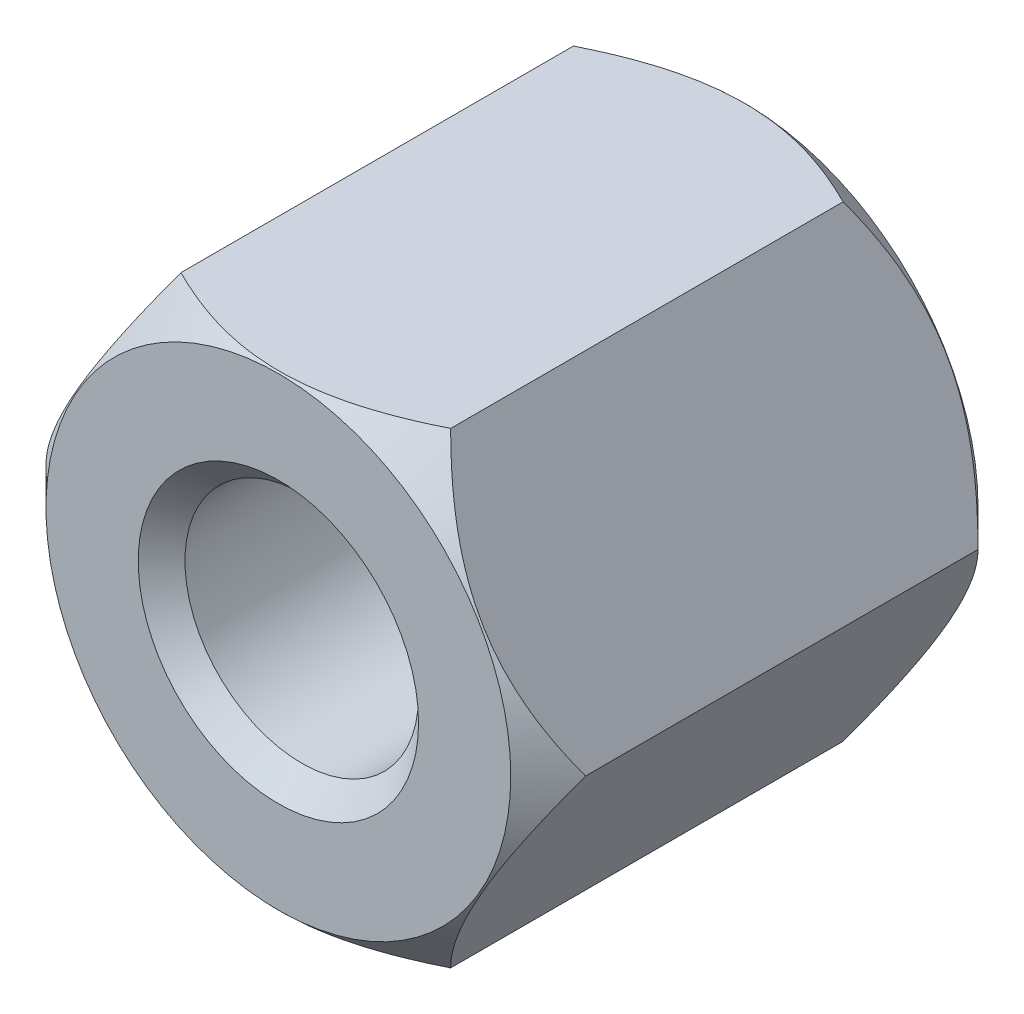
ISO-10303-21;
HEADER;
FILE_DESCRIPTION(('STEP AP214'),'2;1');
FILE_NAME('part.step','',(''),(''),'','','');
FILE_SCHEMA(('AUTOMOTIVE_DESIGN { 1 0 10303 214 1 1 1 1 }'));
ENDSEC;
DATA;
#1=APPLICATION_CONTEXT('core data for automotive mechanical design processes');
#2=APPLICATION_PROTOCOL_DEFINITION('international standard','automotive_design',2000,#1);
#3=PRODUCT_CONTEXT('',#1,'mechanical');
#4=PRODUCT('Part','Part','',(#3));
#5=PRODUCT_RELATED_PRODUCT_CATEGORY('part','',(#4));
#6=PRODUCT_DEFINITION_FORMATION('','',#4);
#7=PRODUCT_DEFINITION_CONTEXT('part definition',#1,'design');
#8=PRODUCT_DEFINITION('design','',#6,#7);
#9=PRODUCT_DEFINITION_SHAPE('','',#8);
#10=(LENGTH_UNIT() NAMED_UNIT(*) SI_UNIT(.MILLI.,.METRE.));
#11=(NAMED_UNIT(*) PLANE_ANGLE_UNIT() SI_UNIT($,.RADIAN.));
#12=(NAMED_UNIT(*) SI_UNIT($,.STERADIAN.) SOLID_ANGLE_UNIT());
#13=UNCERTAINTY_MEASURE_WITH_UNIT(LENGTH_MEASURE(1.E-05),#10,'distance_accuracy_value','');
#14=(GEOMETRIC_REPRESENTATION_CONTEXT(3) GLOBAL_UNCERTAINTY_ASSIGNED_CONTEXT((#13)) GLOBAL_UNIT_ASSIGNED_CONTEXT((#10,
#11,#12)) REPRESENTATION_CONTEXT('',''));
#15=CARTESIAN_POINT('',(0.,0.,0.));
#16=DIRECTION('',(0.,0.,1.));
#17=DIRECTION('',(1.,0.,0.));
#18=AXIS2_PLACEMENT_3D('',#15,#16,#17);
#19=CARTESIAN_POINT('',(1.44337567297409,-2.49999999999998,2.5));
#20=DIRECTION('',(-0.866025403784442,0.499999999999995,0.));
#21=DIRECTION('',(-0.499999999999995,-0.866025403784442,0.));
#22=AXIS2_PLACEMENT_3D('',#19,#20,#21);
#23=PLANE('',#22);
#24=CARTESIAN_POINT('',(1.44326020292026,-2.50019999999998,2.09988452301824));
#25=CARTESIAN_POINT('',(1.49287669073471,-2.41426172221222,2.14945929464527));
#26=CARTESIAN_POINT('',(1.54332283764113,-2.32688643272423,2.19612251863749));
#27=CARTESIAN_POINT('',(1.64618811625262,-2.1487185438344,2.2815618599617));
#28=CARTESIAN_POINT('',(1.69861703122362,-2.05790899931891,2.32029043759399));
#29=CARTESIAN_POINT('',(1.80433744175988,-1.87479587687307,2.38663329610226));
#30=CARTESIAN_POINT('',(1.85760201171318,-1.78253893547065,2.41441433146914));
#31=CARTESIAN_POINT('',(1.96530378549011,-1.5959939912237,2.45721682408933));
#32=CARTESIAN_POINT('',(2.01973769896309,-1.50171168743371,2.47227023332865));
#33=CARTESIAN_POINT('',(2.11355131286835,-1.33922174170814,2.48585227779051));
#34=CARTESIAN_POINT('',(2.15280980880343,-1.27122403211984,2.48786290075919));
#35=CARTESIAN_POINT('',(2.23126263056551,-1.13533975883077,2.4844758828125));
#36=CARTESIAN_POINT('',(2.27045692907359,-1.06745324244775,2.47907564470017));
#37=CARTESIAN_POINT('',(2.34847544336506,-0.932321211763879,2.46117421159752));
#38=CARTESIAN_POINT('',(2.38729919566125,-0.865076500246424,2.44866507295351));
#39=CARTESIAN_POINT('',(2.46427534467605,-0.731749899181784,2.41723249804428));
#40=CARTESIAN_POINT('',(2.50242779262543,-0.665667920900326,2.39830955350317));
#41=CARTESIAN_POINT('',(2.60015256308363,-0.496403653308721,2.34213263859174));
#42=CARTESIAN_POINT('',(2.6591189485299,-0.394270877777096,2.3006441684038));
#43=CARTESIAN_POINT('',(2.74582384890658,-0.244093585059485,2.23060595327691));
#44=CARTESIAN_POINT('',(2.77439698586413,-0.194603460117386,2.20599774788392));
#45=CARTESIAN_POINT('',(2.83101398781794,-0.0965399361611509,2.15453811328476));
#46=CARTESIAN_POINT('',(2.85905816495513,-0.0479659965030709,2.12768806122064));
#47=CARTESIAN_POINT('',(2.88686681600197,0.000199999999999824,2.09988452301824));
#48=B_SPLINE_CURVE_WITH_KNOTS('',3,(#24,#25,#26,#27,#28,#29,#30,#31,#32,#33,#34,#35,#36,#37,#38,
#39,#40,#41,#42,#43,#44,#45,#46,#47),.UNSPECIFIED.,.F.,.F.,(4,2,2,2,2,2,2,2,2,2,2,4),(0.,
0.333012085133921,0.667964518301391,0.99759703204329,1.32639954393843,1.56169424147168,
1.79707142102082,2.0327121352217,2.2683347877565,2.64260240809531,2.82922877818861,
3.01574133749022),.UNSPECIFIED.);
#49=CARTESIAN_POINT('',(1.44337567297409,-2.49999999999998,2.1));
#50=VERTEX_POINT('',#49);
#51=CARTESIAN_POINT('',(2.88675134594813,0.,2.1));
#52=VERTEX_POINT('',#51);
#53=EDGE_CURVE('E88',#50,#52,#48,.T.);
#54=ORIENTED_EDGE('',*,*,#53,.F.);
#55=DIRECTION('',(0.,0.,-1.));
#56=VECTOR('',#55,1.);
#57=CARTESIAN_POINT('',(1.44337567297409,-2.49999999999998,2.5));
#58=LINE('',#57,#56);
#59=CARTESIAN_POINT('',(1.44337567297409,-2.49999999999998,-2.1));
#60=VERTEX_POINT('',#59);
#61=EDGE_CURVE('E59',#50,#60,#58,.T.);
#62=ORIENTED_EDGE('',*,*,#61,.T.);
#63=CARTESIAN_POINT('',(2.88686681600197,0.0002,-2.09988452301824));
#64=CARTESIAN_POINT('',(2.83725032818751,-0.0857382777877644,-2.14945929464527));
#65=CARTESIAN_POINT('',(2.7868041812811,-0.173113567275753,-2.19612251863749));
#66=CARTESIAN_POINT('',(2.68393890266961,-0.351281456165588,-2.2815618599617));
#67=CARTESIAN_POINT('',(2.63150998769861,-0.442091000681073,-2.32029043759399));
#68=CARTESIAN_POINT('',(2.52578957716235,-0.625204123126919,-2.38663329610226));
#69=CARTESIAN_POINT('',(2.47252500720905,-0.717461064529338,-2.41441433146914));
#70=CARTESIAN_POINT('',(2.36482323343211,-0.904006008776283,-2.45721682408933));
#71=CARTESIAN_POINT('',(2.31038931995914,-0.99828831256628,-2.47227023332865));
#72=CARTESIAN_POINT('',(2.21657570605388,-1.16077825829184,-2.48585227779051));
#73=CARTESIAN_POINT('',(2.17731721011879,-1.22877596788015,-2.48786290075919));
#74=CARTESIAN_POINT('',(2.09886438835671,-1.36466024116922,-2.4844758828125));
#75=CARTESIAN_POINT('',(2.05967008984863,-1.43254675755224,-2.47907564470017));
#76=CARTESIAN_POINT('',(1.98165157555716,-1.56767878823611,-2.46117421159752));
#77=CARTESIAN_POINT('',(1.94282782326098,-1.63492349975356,-2.44866507295351));
#78=CARTESIAN_POINT('',(1.86585167424617,-1.7682501008182,-2.41723249804428));
#79=CARTESIAN_POINT('',(1.82769922629679,-1.83433207909966,-2.39830955350317));
#80=CARTESIAN_POINT('',(1.72997445583859,-2.00359634669126,-2.34213263859174));
#81=CARTESIAN_POINT('',(1.67100807039233,-2.10572912222289,-2.3006441684038));
#82=CARTESIAN_POINT('',(1.58430317001565,-2.2559064149405,-2.23060595327691));
#83=CARTESIAN_POINT('',(1.5557300330581,-2.3053965398826,-2.20599774788392));
#84=CARTESIAN_POINT('',(1.49911303110428,-2.40346006383883,-2.15453811328476));
#85=CARTESIAN_POINT('',(1.47106885396709,-2.45203400349691,-2.12768806122064));
#86=CARTESIAN_POINT('',(1.44326020292026,-2.50019999999999,-2.09988452301824));
#87=B_SPLINE_CURVE_WITH_KNOTS('',3,(#63,#64,#65,#66,#67,#68,#69,#70,#71,#72,#73,#74,#75,#76,#77,
#78,#79,#80,#81,#82,#83,#84,#85,#86),.UNSPECIFIED.,.F.,.F.,(4,2,2,2,2,2,2,2,2,2,2,4),(0.,
0.333012085133921,0.667964518301392,0.997597032043291,1.32639954393843,1.56169424147168,
1.79707142102082,2.0327121352217,2.2683347877565,2.64260240809531,2.82922877818861,
3.01574133749022),.UNSPECIFIED.);
#88=CARTESIAN_POINT('',(2.88675134594813,0.,-2.1));
#89=VERTEX_POINT('',#88);
#90=EDGE_CURVE('E106',#89,#60,#87,.T.);
#91=ORIENTED_EDGE('',*,*,#90,.F.);
#92=DIRECTION('',(0.,0.,-1.));
#93=VECTOR('',#92,1.);
#94=CARTESIAN_POINT('',(2.88675134594813,0.,2.5));
#95=LINE('',#94,#93);
#96=EDGE_CURVE('E101',#52,#89,#95,.T.);
#97=ORIENTED_EDGE('',*,*,#96,.F.);
#98=EDGE_LOOP('',(#54,#62,#91,#97));
#99=FACE_BOUND('',#98,.T.);
#100=ADVANCED_FACE('F35',(#99),#23,.F.);
#101=CARTESIAN_POINT('',(2.88675134594813,0.,2.5));
#102=DIRECTION('',(-0.866025403784438,-0.500000000000001,0.));
#103=DIRECTION('',(0.500000000000001,-0.866025403784438,0.));
#104=AXIS2_PLACEMENT_3D('',#101,#102,#103);
#105=PLANE('',#104);
#106=CARTESIAN_POINT('',(2.88686681600197,-0.000200000000000088,2.09988452301824));
#107=CARTESIAN_POINT('',(2.83725032818751,0.0857382777877652,2.14945929464527));
#108=CARTESIAN_POINT('',(2.7868041812811,0.173113567275754,2.1961225186375));
#109=CARTESIAN_POINT('',(2.6839389026696,0.35128145616559,2.2815618599617));
#110=CARTESIAN_POINT('',(2.6315099876986,0.442091000681076,2.320290437594));
#111=CARTESIAN_POINT('',(2.52578957716234,0.625204123126923,2.38663329610226));
#112=CARTESIAN_POINT('',(2.47252500720904,0.717461064529343,2.41441433146915));
#113=CARTESIAN_POINT('',(2.3648232334321,0.904006008776289,2.45721682408934));
#114=CARTESIAN_POINT('',(2.31038931995913,0.998288312566287,2.47227023332866));
#115=CARTESIAN_POINT('',(2.21657570605386,1.16077825829185,2.48585227779052));
#116=CARTESIAN_POINT('',(2.17731721011878,1.22877596788016,2.4878629007592));
#117=CARTESIAN_POINT('',(2.0988643883567,1.36466024116922,2.48447588281251));
#118=CARTESIAN_POINT('',(2.05967008984862,1.43254675755224,2.47907564470018));
#119=CARTESIAN_POINT('',(1.98165157555714,1.56767878823611,2.46117421159753));
#120=CARTESIAN_POINT('',(1.94282782326096,1.63492349975357,2.44866507295352));
#121=CARTESIAN_POINT('',(1.86585167424616,1.7682501008182,2.41723249804429));
#122=CARTESIAN_POINT('',(1.82769922629677,1.83433207909966,2.39830955350318));
#123=CARTESIAN_POINT('',(1.72997445583857,2.00359634669127,2.34213263859175));
#124=CARTESIAN_POINT('',(1.6710080703923,2.1057291222229,2.30064416840381));
#125=CARTESIAN_POINT('',(1.58430317001562,2.25590641494051,2.23060595327691));
#126=CARTESIAN_POINT('',(1.55573003305807,2.30539653988261,2.20599774788393));
#127=CARTESIAN_POINT('',(1.49911303110425,2.40346006383885,2.15453811328476));
#128=CARTESIAN_POINT('',(1.47106885396706,2.45203400349693,2.12768806122064));
#129=CARTESIAN_POINT('',(1.44326020292022,2.50020000000001,2.09988452301824));
#130=B_SPLINE_CURVE_WITH_KNOTS('',3,(#106,#107,#108,#109,#110,#111,#112,#113,#114,#115,#116,
#117,#118,#119,#120,#121,#122,#123,#124,#125,#126,#127,#128,#129),.UNSPECIFIED.,.F.,.F.,(4,2,2,
2,2,2,2,2,2,2,2,4),(0.,0.333012085133925,0.6679645183014,0.997597032043303,1.32639954393845,
1.56169424147169,1.79707142102083,2.03271213522171,2.26833478775651,2.64260240809534,
2.82922877818865,3.01574133749026),.UNSPECIFIED.);
#131=CARTESIAN_POINT('',(1.44337567297406,2.50000000000001,2.1));
#132=VERTEX_POINT('',#131);
#133=EDGE_CURVE('E91',#52,#132,#130,.T.);
#134=ORIENTED_EDGE('',*,*,#133,.F.);
#135=ORIENTED_EDGE('',*,*,#96,.T.);
#136=CARTESIAN_POINT('',(1.44326020292022,2.50020000000001,-2.09988452301824));
#137=CARTESIAN_POINT('',(1.49287669073468,2.41426172221224,-2.14945929464527));
#138=CARTESIAN_POINT('',(1.54332283764109,2.32688643272425,-2.1961225186375));
#139=CARTESIAN_POINT('',(1.64618811625259,2.14871854383442,-2.2815618599617));
#140=CARTESIAN_POINT('',(1.69861703122359,2.05790899931893,-2.320290437594));
#141=CARTESIAN_POINT('',(1.80433744175985,1.87479587687308,-2.38663329610226));
#142=CARTESIAN_POINT('',(1.85760201171315,1.78253893547066,-2.41441433146914));
#143=CARTESIAN_POINT('',(1.96530378549009,1.59599399122372,-2.45721682408934));
#144=CARTESIAN_POINT('',(2.01973769896306,1.50171168743372,-2.47227023332866));
#145=CARTESIAN_POINT('',(2.11355131286833,1.33922174170815,-2.48585227779052));
#146=CARTESIAN_POINT('',(2.15280980880341,1.27122403211985,-2.4878629007592));
#147=CARTESIAN_POINT('',(2.23126263056549,1.13533975883078,-2.48447588281251));
#148=CARTESIAN_POINT('',(2.27045692907358,1.06745324244776,-2.47907564470018));
#149=CARTESIAN_POINT('',(2.34847544336505,0.932321211763893,-2.46117421159753));
#150=CARTESIAN_POINT('',(2.38729919566123,0.865076500246439,-2.44866507295352));
#151=CARTESIAN_POINT('',(2.46427534467604,0.7317498991818,-2.41723249804429));
#152=CARTESIAN_POINT('',(2.50242779262542,0.665667920900342,-2.39830955350318));
#153=CARTESIAN_POINT('',(2.60015256308362,0.496403653308734,-2.34213263859175));
#154=CARTESIAN_POINT('',(2.65911894852989,0.394270877777106,-2.30064416840381));
#155=CARTESIAN_POINT('',(2.74582384890657,0.244093585059491,-2.23060595327691));
#156=CARTESIAN_POINT('',(2.77439698586412,0.19460346011739,-2.20599774788393));
#157=CARTESIAN_POINT('',(2.83101398781794,0.096539936161153,-2.15453811328476));
#158=CARTESIAN_POINT('',(2.85905816495513,0.0479659965030718,-2.12768806122065));
#159=CARTESIAN_POINT('',(2.88686681600197,-0.000200000000000265,-2.09988452301824));
#160=B_SPLINE_CURVE_WITH_KNOTS('',3,(#136,#137,#138,#139,#140,#141,#142,#143,#144,#145,#146,
#147,#148,#149,#150,#151,#152,#153,#154,#155,#156,#157,#158,#159),.UNSPECIFIED.,.F.,.F.,(4,2,2,
2,2,2,2,2,2,2,2,4),(0.,0.333012085133926,0.6679645183014,0.997597032043304,1.32639954393845,
1.56169424147169,1.79707142102084,2.03271213522172,2.26833478775651,2.64260240809534,
2.82922877818865,3.01574133749026),.UNSPECIFIED.);
#161=CARTESIAN_POINT('',(1.44337567297406,2.50000000000001,-2.1));
#162=VERTEX_POINT('',#161);
#163=EDGE_CURVE('E188',#162,#89,#160,.T.);
#164=ORIENTED_EDGE('',*,*,#163,.F.);
#165=DIRECTION('',(0.,0.,-1.));
#166=VECTOR('',#165,1.);
#167=CARTESIAN_POINT('',(1.44337567297406,2.50000000000001,2.5));
#168=LINE('',#167,#166);
#169=EDGE_CURVE('E103',#132,#162,#168,.T.);
#170=ORIENTED_EDGE('',*,*,#169,.F.);
#171=EDGE_LOOP('',(#134,#135,#164,#170));
#172=FACE_BOUND('',#171,.T.);
#173=ADVANCED_FACE('F99',(#172),#105,.F.);
#174=CARTESIAN_POINT('',(1.44337567297406,2.50000000000001,2.5));
#175=DIRECTION('',(0.,-1.,0.));
#176=DIRECTION('',(1.,0.,0.));
#177=AXIS2_PLACEMENT_3D('',#174,#175,#176);
#178=PLANE('',#177);
#179=CARTESIAN_POINT('',(4.35790807222665,2.50000000000002,-0.037326954195904));
#180=CARTESIAN_POINT('',(4.22900505074815,2.50000000000001,0.0744402065116866));
#181=CARTESIAN_POINT('',(4.09952897907172,2.50000000000001,0.185560094395842));
#182=CARTESIAN_POINT('',(3.83898638028681,2.50000000000001,0.406043749151144));
#183=CARTESIAN_POINT('',(3.70791912620545,2.50000000000001,0.515406655880432));
#184=CARTESIAN_POINT('',(3.44083760855067,2.50000000000001,0.734294074919611));
#185=CARTESIAN_POINT('',(3.30477887797079,2.50000000000001,0.843764542990698));
#186=CARTESIAN_POINT('',(3.03009587684347,2.50000000000001,1.05938263287972));
#187=CARTESIAN_POINT('',(2.89147225782006,2.50000000000001,1.1655310805966));
#188=CARTESIAN_POINT('',(2.61062429451692,2.50000000000001,1.37338578520497));
#189=CARTESIAN_POINT('',(2.46839537969833,2.50000000000001,1.47508590704006));
#190=CARTESIAN_POINT('',(2.17925486790779,2.50000000000001,1.67194970638112));
#191=CARTESIAN_POINT('',(2.03233957265131,2.50000000000001,1.76710802470617));
#192=CARTESIAN_POINT('',(1.73361597358267,2.50000000000001,1.94680833734888));
#193=CARTESIAN_POINT('',(1.58185407011245,2.50000000000001,2.0314264527755));
#194=CARTESIAN_POINT('',(1.2708413052791,2.5,2.18552599595446));
#195=CARTESIAN_POINT('',(1.11160488303031,2.5,2.25503525688873));
#196=CARTESIAN_POINT('',(0.864657376231794,2.5,2.34259642513528));
#197=CARTESIAN_POINT('',(0.779993026222509,2.5,2.36920046305057));
#198=CARTESIAN_POINT('',(0.608668935092162,2.5,2.41504582346073));
#199=CARTESIAN_POINT('',(0.522009514777881,2.5,2.43428832104285));
#200=CARTESIAN_POINT('',(0.347739556932325,2.5,2.4641318069513));
#201=CARTESIAN_POINT('',(0.260138222188811,2.5,2.47478552783328));
#202=CARTESIAN_POINT('',(0.0842961272603024,2.5,2.48686770307153));
#203=CARTESIAN_POINT('',(-0.00394456438845738,2.5,2.48829713200226));
#204=CARTESIAN_POINT('',(-0.180192018780225,2.5,2.48181608276146));
#205=CARTESIAN_POINT('',(-0.268198313940598,2.5,2.47389317264443));
#206=CARTESIAN_POINT('',(-0.442968473014189,2.5,2.44928693602143));
#207=CARTESIAN_POINT('',(-0.52973208846052,2.5,2.43260188201526));
#208=CARTESIAN_POINT('',(-0.702003641636151,2.5,2.39141807606218));
#209=CARTESIAN_POINT('',(-0.787498274243368,2.5,2.36686463906261));
#210=CARTESIAN_POINT('',(-0.956318998116797,2.5,2.31127227919822));
#211=CARTESIAN_POINT('',(-1.03964506444264,2.5,2.28023328178095));
#212=CARTESIAN_POINT('',(-1.22260914379838,2.5,2.20532752613878));
#213=CARTESIAN_POINT('',(-1.32170415747566,2.5,2.16014559308747));
#214=CARTESIAN_POINT('',(-1.51694385371063,2.49999999999999,2.06375515379206));
#215=CARTESIAN_POINT('',(-1.61308679170489,2.49999999999999,2.01254316726493));
#216=CARTESIAN_POINT('',(-1.80296614219633,2.49999999999999,1.90543166741099));
#217=CARTESIAN_POINT('',(-1.89669715950611,2.49999999999999,1.84952266760243));
#218=CARTESIAN_POINT('',(-2.08192800240944,2.49999999999999,1.73418674307864));
#219=CARTESIAN_POINT('',(-2.17342826625818,2.49999999999999,1.67476051735265));
#220=CARTESIAN_POINT('',(-2.35505847652765,2.49999999999999,1.5528403036759));
#221=CARTESIAN_POINT('',(-2.44517856997307,2.49999999999999,1.49033170499243));
#222=CARTESIAN_POINT('',(-2.62385919422453,2.49999999999999,1.36311875000845));
#223=CARTESIAN_POINT('',(-2.71241960671459,2.49999999999999,1.29841422820772));
#224=CARTESIAN_POINT('',(-2.97593968609539,2.49999999999999,1.10184992046108));
#225=CARTESIAN_POINT('',(-3.14895696314847,2.49999999999999,0.967389294841458));
#226=CARTESIAN_POINT('',(-3.4972764403502,2.49999999999999,0.689118167010652));
#227=CARTESIAN_POINT('',(-3.67244750970823,2.49999999999999,0.545145129018908));
#228=CARTESIAN_POINT('',(-3.93212110001532,2.49999999999999,0.327416245386722));
#229=CARTESIAN_POINT('',(-4.01770626505478,2.49999999999999,0.254945312328529));
#230=CARTESIAN_POINT('',(-4.18824952148342,2.49999999999999,0.109306088881485));
#231=CARTESIAN_POINT('',(-4.2732077442148,2.49999999999999,0.0361379523639312));
#232=CARTESIAN_POINT('',(-4.35790807222667,2.49999999999999,-0.0373269541959038));
#233=B_SPLINE_CURVE_WITH_KNOTS('',3,(#179,#180,#181,#182,#183,#184,#185,#186,#187,#188,#189,
#190,#191,#192,#193,#194,#195,#196,#197,#198,#199,#200,#201,#202,#203,#204,#205,#206,#207,#208,
#209,#210,#211,#212,#213,#214,#215,#216,#217,#218,#219,#220,#221,#222,#223,#224,#225,#226,#227,
#228,#229,#230,#231,#232),.UNSPECIFIED.,.F.,.F.,(4,2,2,2,2,2,2,2,2,2,2,2,2,2,2,2,2,2,2,2,2,2,2,
2,2,2,4),(0.,0.511842212813336,1.02392780167291,1.54778169920521,2.0715043079768,
2.59592780979257,3.12077593308528,3.64158173065561,4.16141982425734,4.42739176689036,
4.69332123596953,4.95760526901696,5.22186137919605,5.48646915760421,5.7511291243468,
6.01766988465734,6.28421370906124,6.61066447125657,6.93730457870708,7.26462103112132,
7.5918726519232,7.92086150920117,8.2498752166992,8.90710736338429,9.58728616124554,
9.92372274140158,10.2600867154781),.UNSPECIFIED.);
#234=CARTESIAN_POINT('',(-1.44337567297408,2.49999999999999,2.1));
#235=VERTEX_POINT('',#234);
#236=EDGE_CURVE('E104',#132,#235,#233,.T.);
#237=ORIENTED_EDGE('',*,*,#236,.F.);
#238=ORIENTED_EDGE('',*,*,#169,.T.);
#239=CARTESIAN_POINT('',(-4.35790807222667,2.49999999999999,0.0373269541959046));
#240=CARTESIAN_POINT('',(-4.22900505074817,2.49999999999999,-0.0744402065116859));
#241=CARTESIAN_POINT('',(-4.09952897907174,2.49999999999999,-0.185560094395842));
#242=CARTESIAN_POINT('',(-3.83898638028682,2.49999999999999,-0.406043749151144));
#243=CARTESIAN_POINT('',(-3.70791912620546,2.49999999999999,-0.515406655880432));
#244=CARTESIAN_POINT('',(-3.44083760855069,2.49999999999999,-0.734294074919611));
#245=CARTESIAN_POINT('',(-3.3047788779708,2.49999999999999,-0.843764542990698));
#246=CARTESIAN_POINT('',(-3.03009587684349,2.49999999999999,-1.05938263287972));
#247=CARTESIAN_POINT('',(-2.89147225782008,2.49999999999999,-1.1655310805966));
#248=CARTESIAN_POINT('',(-2.61062429451693,2.49999999999999,-1.37338578520497));
#249=CARTESIAN_POINT('',(-2.46839537969834,2.49999999999999,-1.47508590704006));
#250=CARTESIAN_POINT('',(-2.1792548679078,2.49999999999999,-1.67194970638112));
#251=CARTESIAN_POINT('',(-2.03233957265132,2.49999999999999,-1.76710802470617));
#252=CARTESIAN_POINT('',(-1.73361597358269,2.49999999999999,-1.94680833734888));
#253=CARTESIAN_POINT('',(-1.58185407011246,2.49999999999999,-2.0314264527755));
#254=CARTESIAN_POINT('',(-1.27084130527911,2.5,-2.18552599595446));
#255=CARTESIAN_POINT('',(-1.11160488303032,2.5,-2.25503525688873));
#256=CARTESIAN_POINT('',(-0.864657376231811,2.5,-2.34259642513528));
#257=CARTESIAN_POINT('',(-0.779993026222527,2.5,-2.36920046305057));
#258=CARTESIAN_POINT('',(-0.608668935092179,2.5,-2.41504582346073));
#259=CARTESIAN_POINT('',(-0.522009514777898,2.5,-2.43428832104285));
#260=CARTESIAN_POINT('',(-0.347739556932342,2.5,-2.4641318069513));
#261=CARTESIAN_POINT('',(-0.260138222188828,2.5,-2.47478552783328));
#262=CARTESIAN_POINT('',(-0.0842961272603192,2.5,-2.48686770307153));
#263=CARTESIAN_POINT('',(0.00394456438844081,2.5,-2.48829713200226));
#264=CARTESIAN_POINT('',(0.180192018780209,2.5,-2.48181608276146));
#265=CARTESIAN_POINT('',(0.268198313940582,2.5,-2.47389317264443));
#266=CARTESIAN_POINT('',(0.442968473014173,2.5,-2.44928693602143));
#267=CARTESIAN_POINT('',(0.529732088460504,2.5,-2.43260188201526));
#268=CARTESIAN_POINT('',(0.702003641636135,2.5,-2.39141807606218));
#269=CARTESIAN_POINT('',(0.787498274243352,2.5,-2.36686463906261));
#270=CARTESIAN_POINT('',(0.956318998116782,2.5,-2.31127227919822));
#271=CARTESIAN_POINT('',(1.03964506444263,2.5,-2.28023328178095));
#272=CARTESIAN_POINT('',(1.22260914379836,2.5,-2.20532752613878));
#273=CARTESIAN_POINT('',(1.32170415747565,2.5,-2.16014559308746));
#274=CARTESIAN_POINT('',(1.51694385371061,2.50000000000001,-2.06375515379206));
#275=CARTESIAN_POINT('',(1.61308679170487,2.50000000000001,-2.01254316726493));
#276=CARTESIAN_POINT('',(1.80296614219631,2.50000000000001,-1.90543166741099));
#277=CARTESIAN_POINT('',(1.8966971595061,2.50000000000001,-1.84952266760243));
#278=CARTESIAN_POINT('',(2.08192800240942,2.50000000000001,-1.73418674307863));
#279=CARTESIAN_POINT('',(2.17342826625816,2.50000000000001,-1.67476051735265));
#280=CARTESIAN_POINT('',(2.35505847652763,2.50000000000001,-1.5528403036759));
#281=CARTESIAN_POINT('',(2.44517856997306,2.50000000000001,-1.49033170499242));
#282=CARTESIAN_POINT('',(2.62385919422451,2.50000000000001,-1.36311875000844));
#283=CARTESIAN_POINT('',(2.71241960671457,2.50000000000001,-1.29841422820772));
#284=CARTESIAN_POINT('',(2.97593968609538,2.50000000000001,-1.10184992046108));
#285=CARTESIAN_POINT('',(3.14895696314845,2.50000000000001,-0.967389294841455));
#286=CARTESIAN_POINT('',(3.49727644035019,2.50000000000001,-0.68911816701065));
#287=CARTESIAN_POINT('',(3.67244750970821,2.50000000000001,-0.545145129018906));
#288=CARTESIAN_POINT('',(3.93212110001531,2.50000000000001,-0.327416245386721));
#289=CARTESIAN_POINT('',(4.01770626505476,2.50000000000001,-0.254945312328527));
#290=CARTESIAN_POINT('',(4.1882495214834,2.50000000000001,-0.109306088881484));
#291=CARTESIAN_POINT('',(4.27320774421478,2.50000000000001,-0.0361379523639301));
#292=CARTESIAN_POINT('',(4.35790807222665,2.50000000000002,0.0373269541959045));
#293=B_SPLINE_CURVE_WITH_KNOTS('',3,(#239,#240,#241,#242,#243,#244,#245,#246,#247,#248,#249,
#250,#251,#252,#253,#254,#255,#256,#257,#258,#259,#260,#261,#262,#263,#264,#265,#266,#267,#268,
#269,#270,#271,#272,#273,#274,#275,#276,#277,#278,#279,#280,#281,#282,#283,#284,#285,#286,#287,
#288,#289,#290,#291,#292),.UNSPECIFIED.,.F.,.F.,(4,2,2,2,2,2,2,2,2,2,2,2,2,2,2,2,2,2,2,2,2,2,2,
2,2,2,4),(0.,0.511842212813336,1.02392780167291,1.54778169920521,2.0715043079768,
2.59592780979257,3.12077593308528,3.64158173065561,4.16141982425734,4.42739176689036,
4.69332123596953,4.95760526901696,5.22186137919606,5.48646915760421,5.7511291243468,
6.01766988465735,6.28421370906124,6.61066447125657,6.93730457870708,7.26462103112132,
7.59187265192321,7.92086150920117,8.24987521669921,8.9071073633843,9.58728616124555,
9.92372274140158,10.2600867154781),.UNSPECIFIED.);
#294=CARTESIAN_POINT('',(-1.44337567297408,2.49999999999999,-2.1));
#295=VERTEX_POINT('',#294);
#296=EDGE_CURVE('E181',#295,#162,#293,.T.);
#297=ORIENTED_EDGE('',*,*,#296,.F.);
#298=DIRECTION('',(0.,0.,-1.));
#299=VECTOR('',#298,1.);
#300=CARTESIAN_POINT('',(-1.44337567297408,2.5,2.5));
#301=LINE('',#300,#299);
#302=EDGE_CURVE('E112',#235,#295,#301,.T.);
#303=ORIENTED_EDGE('',*,*,#302,.F.);
#304=EDGE_LOOP('',(#237,#238,#297,#303));
#305=FACE_BOUND('',#304,.T.);
#306=ADVANCED_FACE('F201',(#305),#178,.F.);
#307=CARTESIAN_POINT('',(-1.44337567297408,2.5,2.5));
#308=DIRECTION('',(0.866025403784442,-0.499999999999995,0.));
#309=DIRECTION('',(0.499999999999995,0.866025403784442,0.));
#310=AXIS2_PLACEMENT_3D('',#307,#308,#309);
#311=PLANE('',#310);
#312=CARTESIAN_POINT('',(-1.44326020292024,2.5002,2.09988452301824));
#313=CARTESIAN_POINT('',(-1.4928766907347,2.41426172221223,2.14945929464527));
#314=CARTESIAN_POINT('',(-1.54332283764111,2.32688643272424,2.19612251863749));
#315=CARTESIAN_POINT('',(-1.6461881162526,2.1487185438344,2.2815618599617));
#316=CARTESIAN_POINT('',(-1.6986170312236,2.05790899931892,2.320290437594));
#317=CARTESIAN_POINT('',(-1.80433744175987,1.87479587687307,2.38663329610226));
#318=CARTESIAN_POINT('',(-1.85760201171316,1.78253893547065,2.41441433146914));
#319=CARTESIAN_POINT('',(-1.9653037854901,1.5959939912237,2.45721682408933));
#320=CARTESIAN_POINT('',(-2.01973769896307,1.50171168743371,2.47227023332866));
#321=CARTESIAN_POINT('',(-2.11355131286833,1.33922174170814,2.48585227779052));
#322=CARTESIAN_POINT('',(-2.15280980880342,1.27122403211984,2.4878629007592));
#323=CARTESIAN_POINT('',(-2.2312626305655,1.13533975883077,2.48447588281251));
#324=CARTESIAN_POINT('',(-2.27045692907358,1.06745324244775,2.47907564470018));
#325=CARTESIAN_POINT('',(-2.34847544336505,0.93232121176388,2.46117421159753));
#326=CARTESIAN_POINT('',(-2.38729919566123,0.865076500246425,2.44866507295352));
#327=CARTESIAN_POINT('',(-2.46427534467604,0.731749899181785,2.41723249804429));
#328=CARTESIAN_POINT('',(-2.50242779262542,0.665667920900327,2.39830955350318));
#329=CARTESIAN_POINT('',(-2.60015256308362,0.496403653308718,2.34213263859175));
#330=CARTESIAN_POINT('',(-2.65911894852989,0.394270877777089,2.30064416840381));
#331=CARTESIAN_POINT('',(-2.74582384890657,0.244093585059472,2.23060595327691));
#332=CARTESIAN_POINT('',(-2.77439698586412,0.194603460117372,2.20599774788393));
#333=CARTESIAN_POINT('',(-2.83101398781794,0.0965399361611335,2.15453811328476));
#334=CARTESIAN_POINT('',(-2.85905816495513,0.0479659965030521,2.12768806122064));
#335=CARTESIAN_POINT('',(-2.88686681600197,-0.000200000000020135,2.09988452301824));
#336=B_SPLINE_CURVE_WITH_KNOTS('',3,(#312,#313,#314,#315,#316,#317,#318,#319,#320,#321,#322,
#323,#324,#325,#326,#327,#328,#329,#330,#331,#332,#333,#334,#335),.UNSPECIFIED.,.F.,.F.,(4,2,2,
2,2,2,2,2,2,2,2,4),(0.,0.333012085133925,0.667964518301399,0.997597032043302,1.32639954393845,
1.56169424147169,1.79707142102083,2.03271213522171,2.26833478775651,2.64260240809534,
2.82922877818865,3.01574133749026),.UNSPECIFIED.);
#337=CARTESIAN_POINT('',(-2.88675134594813,0.,2.1));
#338=VERTEX_POINT('',#337);
#339=EDGE_CURVE('E215',#235,#338,#336,.T.);
#340=ORIENTED_EDGE('',*,*,#339,.F.);
#341=ORIENTED_EDGE('',*,*,#302,.T.);
#342=CARTESIAN_POINT('',(-2.88686681600197,-0.000200000000020158,-2.09988452301824));
#343=CARTESIAN_POINT('',(-2.83725032818751,0.0857382777877449,-2.14945929464527));
#344=CARTESIAN_POINT('',(-2.7868041812811,0.173113567275734,-2.1961225186375));
#345=CARTESIAN_POINT('',(-2.68393890266961,0.351281456165571,-2.2815618599617));
#346=CARTESIAN_POINT('',(-2.6315099876986,0.442091000681057,-2.320290437594));
#347=CARTESIAN_POINT('',(-2.52578957716234,0.625204123126905,-2.38663329610226));
#348=CARTESIAN_POINT('',(-2.47252500720904,0.717461064529325,-2.41441433146914));
#349=CARTESIAN_POINT('',(-2.36482323343211,0.904006008776272,-2.45721682408934));
#350=CARTESIAN_POINT('',(-2.31038931995913,0.99828831256627,-2.47227023332866));
#351=CARTESIAN_POINT('',(-2.21657570605387,1.16077825829183,-2.48585227779052));
#352=CARTESIAN_POINT('',(-2.17731721011879,1.22877596788014,-2.4878629007592));
#353=CARTESIAN_POINT('',(-2.09886438835671,1.36466024116921,-2.48447588281251));
#354=CARTESIAN_POINT('',(-2.05967008984863,1.43254675755223,-2.47907564470018));
#355=CARTESIAN_POINT('',(-1.98165157555716,1.5676787882361,-2.46117421159753));
#356=CARTESIAN_POINT('',(-1.94282782326097,1.63492349975355,-2.44866507295352));
#357=CARTESIAN_POINT('',(-1.86585167424617,1.76825010081819,-2.41723249804429));
#358=CARTESIAN_POINT('',(-1.82769922629679,1.83433207909965,-2.39830955350318));
#359=CARTESIAN_POINT('',(-1.72997445583859,2.00359634669126,-2.34213263859175));
#360=CARTESIAN_POINT('',(-1.67100807039232,2.10572912222289,-2.30064416840381));
#361=CARTESIAN_POINT('',(-1.58430317001563,2.2559064149405,-2.23060595327691));
#362=CARTESIAN_POINT('',(-1.55573003305808,2.3053965398826,-2.20599774788393));
#363=CARTESIAN_POINT('',(-1.49911303110427,2.40346006383884,-2.15453811328476));
#364=CARTESIAN_POINT('',(-1.47106885396707,2.45203400349692,-2.12768806122064));
#365=CARTESIAN_POINT('',(-1.44326020292024,2.5002,-2.09988452301824));
#366=B_SPLINE_CURVE_WITH_KNOTS('',3,(#342,#343,#344,#345,#346,#347,#348,#349,#350,#351,#352,
#353,#354,#355,#356,#357,#358,#359,#360,#361,#362,#363,#364,#365),.UNSPECIFIED.,.F.,.F.,(4,2,2,
2,2,2,2,2,2,2,2,4),(0.,0.333012085133925,0.667964518301399,0.997597032043302,1.32639954393845,
1.56169424147169,1.79707142102083,2.03271213522171,2.26833478775651,2.64260240809534,
2.82922877818865,3.01574133749026),.UNSPECIFIED.);
#367=CARTESIAN_POINT('',(-2.88675134594813,0.,-2.1));
#368=VERTEX_POINT('',#367);
#369=EDGE_CURVE('E174',#368,#295,#366,.T.);
#370=ORIENTED_EDGE('',*,*,#369,.F.);
#371=DIRECTION('',(0.,0.,-1.));
#372=VECTOR('',#371,1.);
#373=CARTESIAN_POINT('',(-2.88675134594813,0.,2.5));
#374=LINE('',#373,#372);
#375=EDGE_CURVE('E345',#338,#368,#374,.T.);
#376=ORIENTED_EDGE('',*,*,#375,.F.);
#377=EDGE_LOOP('',(#340,#341,#370,#376));
#378=FACE_BOUND('',#377,.T.);
#379=ADVANCED_FACE('F226',(#378),#311,.F.);
#380=CARTESIAN_POINT('',(-2.88675134594813,0.,2.5));
#381=DIRECTION('',(0.866025403784435,0.500000000000007,0.));
#382=DIRECTION('',(-0.500000000000007,0.866025403784435,0.));
#383=AXIS2_PLACEMENT_3D('',#380,#381,#382);
#384=PLANE('',#383);
#385=CARTESIAN_POINT('',(-2.88686681600197,0.000199999999979928,2.09988452301824));
#386=CARTESIAN_POINT('',(-2.83725032818751,-0.0857382777877849,2.14945929464527));
#387=CARTESIAN_POINT('',(-2.7868041812811,-0.173113567275773,2.1961225186375));
#388=CARTESIAN_POINT('',(-2.6839389026696,-0.351281456165609,2.2815618599617));
#389=CARTESIAN_POINT('',(-2.6315099876986,-0.442091000681095,2.320290437594));
#390=CARTESIAN_POINT('',(-2.52578957716233,-0.625204123126941,2.38663329610226));
#391=CARTESIAN_POINT('',(-2.47252500720903,-0.71746106452936,2.41441433146914));
#392=CARTESIAN_POINT('',(-2.36482323343209,-0.904006008776305,2.45721682408934));
#393=CARTESIAN_POINT('',(-2.31038931995912,-0.998288312566302,2.47227023332866));
#394=CARTESIAN_POINT('',(-2.21657570605386,-1.16077825829186,2.48585227779052));
#395=CARTESIAN_POINT('',(-2.17731721011877,-1.22877596788017,2.4878629007592));
#396=CARTESIAN_POINT('',(-2.09886438835669,-1.36466024116924,2.48447588281251));
#397=CARTESIAN_POINT('',(-2.05967008984861,-1.43254675755226,2.47907564470018));
#398=CARTESIAN_POINT('',(-1.98165157555713,-1.56767878823612,2.46117421159753));
#399=CARTESIAN_POINT('',(-1.94282782326095,-1.63492349975358,2.44866507295352));
#400=CARTESIAN_POINT('',(-1.86585167424614,-1.76825010081822,2.41723249804429));
#401=CARTESIAN_POINT('',(-1.82769922629676,-1.83433207909967,2.39830955350318));
#402=CARTESIAN_POINT('',(-1.72997445583856,-2.00359634669128,2.34213263859175));
#403=CARTESIAN_POINT('',(-1.67100807039229,-2.10572912222291,2.30064416840381));
#404=CARTESIAN_POINT('',(-1.5843031700156,-2.25590641494053,2.23060595327691));
#405=CARTESIAN_POINT('',(-1.55573003305805,-2.30539653988263,2.20599774788393));
#406=CARTESIAN_POINT('',(-1.49911303110423,-2.40346006383886,2.15453811328476));
#407=CARTESIAN_POINT('',(-1.47106885396704,-2.45203400349694,2.12768806122064));
#408=CARTESIAN_POINT('',(-1.4432602029202,-2.50020000000002,2.09988452301824));
#409=B_SPLINE_CURVE_WITH_KNOTS('',3,(#385,#386,#387,#388,#389,#390,#391,#392,#393,#394,#395,
#396,#397,#398,#399,#400,#401,#402,#403,#404,#405,#406,#407,#408),.UNSPECIFIED.,.F.,.F.,(4,2,2,
2,2,2,2,2,2,2,2,4),(0.,0.333012085133926,0.6679645183014,0.997597032043303,1.32639954393845,
1.56169424147169,1.79707142102083,2.03271213522171,2.26833478775651,2.64260240809534,
2.82922877818865,3.01574133749026),.UNSPECIFIED.);
#410=CARTESIAN_POINT('',(-1.44337567297404,-2.50000000000001,2.1));
#411=VERTEX_POINT('',#410);
#412=EDGE_CURVE('E51',#338,#411,#409,.T.);
#413=ORIENTED_EDGE('',*,*,#412,.F.);
#414=ORIENTED_EDGE('',*,*,#375,.T.);
#415=CARTESIAN_POINT('',(-1.4432602029202,-2.50020000000002,-2.09988452301824));
#416=CARTESIAN_POINT('',(-1.49287669073466,-2.41426172221225,-2.14945929464527));
#417=CARTESIAN_POINT('',(-1.54332283764108,-2.32688643272426,-2.1961225186375));
#418=CARTESIAN_POINT('',(-1.64618811625257,-2.14871854383443,-2.2815618599617));
#419=CARTESIAN_POINT('',(-1.69861703122358,-2.05790899931894,-2.320290437594));
#420=CARTESIAN_POINT('',(-1.80433744175984,-1.87479587687309,-2.38663329610226));
#421=CARTESIAN_POINT('',(-1.85760201171314,-1.78253893547067,-2.41441433146915));
#422=CARTESIAN_POINT('',(-1.96530378549008,-1.59599399122373,-2.45721682408934));
#423=CARTESIAN_POINT('',(-2.01973769896305,-1.50171168743373,-2.47227023332866));
#424=CARTESIAN_POINT('',(-2.11355131286832,-1.33922174170817,-2.48585227779052));
#425=CARTESIAN_POINT('',(-2.1528098088034,-1.27122403211986,-2.4878629007592));
#426=CARTESIAN_POINT('',(-2.23126263056549,-1.1353397588308,-2.48447588281251));
#427=CARTESIAN_POINT('',(-2.27045692907357,-1.06745324244778,-2.47907564470018));
#428=CARTESIAN_POINT('',(-2.34847544336504,-0.93232121176391,-2.46117421159753));
#429=CARTESIAN_POINT('',(-2.38729919566122,-0.865076500246456,-2.44866507295352));
#430=CARTESIAN_POINT('',(-2.46427534467603,-0.731749899181817,-2.41723249804429));
#431=CARTESIAN_POINT('',(-2.50242779262541,-0.665667920900359,-2.39830955350318));
#432=CARTESIAN_POINT('',(-2.60015256308361,-0.496403653308753,-2.34213263859175));
#433=CARTESIAN_POINT('',(-2.65911894852988,-0.394270877777125,-2.30064416840381));
#434=CARTESIAN_POINT('',(-2.74582384890657,-0.24409358505951,-2.23060595327691));
#435=CARTESIAN_POINT('',(-2.77439698586412,-0.19460346011741,-2.20599774788393));
#436=CARTESIAN_POINT('',(-2.83101398781794,-0.0965399361611731,-2.15453811328476));
#437=CARTESIAN_POINT('',(-2.85905816495513,-0.0479659965030921,-2.12768806122064));
#438=CARTESIAN_POINT('',(-2.88686681600197,0.000199999999980001,-2.09988452301824));
#439=B_SPLINE_CURVE_WITH_KNOTS('',3,(#415,#416,#417,#418,#419,#420,#421,#422,#423,#424,#425,
#426,#427,#428,#429,#430,#431,#432,#433,#434,#435,#436,#437,#438),.UNSPECIFIED.,.F.,.F.,(4,2,2,
2,2,2,2,2,2,2,2,4),(0.,0.333012085133925,0.6679645183014,0.997597032043303,1.32639954393845,
1.56169424147169,1.79707142102084,2.03271213522171,2.26833478775651,2.64260240809534,
2.82922877818865,3.01574133749026),.UNSPECIFIED.);
#440=CARTESIAN_POINT('',(-1.44337567297404,-2.50000000000002,-2.1));
#441=VERTEX_POINT('',#440);
#442=EDGE_CURVE('E139',#441,#368,#439,.T.);
#443=ORIENTED_EDGE('',*,*,#442,.F.);
#444=DIRECTION('',(0.,0.,-1.));
#445=VECTOR('',#444,1.);
#446=CARTESIAN_POINT('',(-1.44337567297404,-2.50000000000001,2.5));
#447=LINE('',#446,#445);
#448=EDGE_CURVE('E348',#411,#441,#447,.T.);
#449=ORIENTED_EDGE('',*,*,#448,.F.);
#450=EDGE_LOOP('',(#413,#414,#443,#449));
#451=FACE_BOUND('',#450,.T.);
#452=ADVANCED_FACE('F229',(#451),#384,.F.);
#453=CARTESIAN_POINT('',(-1.44337567297404,-2.50000000000001,2.5));
#454=DIRECTION('',(0.,1.,0.));
#455=DIRECTION('',(-1.,0.,0.));
#456=AXIS2_PLACEMENT_3D('',#453,#454,#455);
#457=PLANE('',#456);
#458=CARTESIAN_POINT('',(-4.35790807222664,-2.50000000000005,-0.0373269541959041));
#459=CARTESIAN_POINT('',(-4.22900505074813,-2.50000000000004,0.0744402065116862));
#460=CARTESIAN_POINT('',(-4.09952897907171,-2.50000000000004,0.185560094395842));
#461=CARTESIAN_POINT('',(-3.83898638028679,-2.50000000000004,0.406043749151144));
#462=CARTESIAN_POINT('',(-3.70791912620543,-2.50000000000004,0.515406655880432));
#463=CARTESIAN_POINT('',(-3.44083760855065,-2.50000000000004,0.734294074919611));
#464=CARTESIAN_POINT('',(-3.30477887797077,-2.50000000000003,0.843764542990698));
#465=CARTESIAN_POINT('',(-3.03009587684345,-2.50000000000003,1.05938263287972));
#466=CARTESIAN_POINT('',(-2.89147225782005,-2.50000000000003,1.1655310805966));
#467=CARTESIAN_POINT('',(-2.6106242945169,-2.50000000000003,1.37338578520497));
#468=CARTESIAN_POINT('',(-2.46839537969831,-2.50000000000003,1.47508590704006));
#469=CARTESIAN_POINT('',(-2.17925486790777,-2.50000000000002,1.67194970638112));
#470=CARTESIAN_POINT('',(-2.03233957265129,-2.50000000000002,1.76710802470617));
#471=CARTESIAN_POINT('',(-1.73361597358266,-2.50000000000002,1.94680833734888));
#472=CARTESIAN_POINT('',(-1.58185407011243,-2.50000000000002,2.0314264527755));
#473=CARTESIAN_POINT('',(-1.27084130527908,-2.50000000000001,2.18552599595446));
#474=CARTESIAN_POINT('',(-1.11160488303029,-2.50000000000001,2.25503525688873));
#475=CARTESIAN_POINT('',(-0.864657376231777,-2.50000000000001,2.34259642513528));
#476=CARTESIAN_POINT('',(-0.779993026222493,-2.50000000000001,2.36920046305057));
#477=CARTESIAN_POINT('',(-0.608668935092145,-2.50000000000001,2.41504582346073));
#478=CARTESIAN_POINT('',(-0.522009514777865,-2.50000000000001,2.43428832104285));
#479=CARTESIAN_POINT('',(-0.347739556932308,-2.5,2.4641318069513));
#480=CARTESIAN_POINT('',(-0.260138222188794,-2.5,2.47478552783328));
#481=CARTESIAN_POINT('',(-0.0842961272602853,-2.5,2.48686770307153));
#482=CARTESIAN_POINT('',(0.00394456438847472,-2.5,2.48829713200226));
#483=CARTESIAN_POINT('',(0.180192018780242,-2.5,2.48181608276146));
#484=CARTESIAN_POINT('',(0.268198313940616,-2.5,2.47389317264443));
#485=CARTESIAN_POINT('',(0.442968473014207,-2.5,2.44928693602143));
#486=CARTESIAN_POINT('',(0.529732088460538,-2.49999999999999,2.43260188201526));
#487=CARTESIAN_POINT('',(0.702003641636169,-2.49999999999999,2.39141807606218));
#488=CARTESIAN_POINT('',(0.787498274243386,-2.49999999999999,2.36686463906261));
#489=CARTESIAN_POINT('',(0.956318998116815,-2.49999999999999,2.31127227919822));
#490=CARTESIAN_POINT('',(1.03964506444266,-2.49999999999999,2.28023328178095));
#491=CARTESIAN_POINT('',(1.2226091437984,-2.49999999999999,2.20532752613878));
#492=CARTESIAN_POINT('',(1.32170415747568,-2.49999999999999,2.16014559308747));
#493=CARTESIAN_POINT('',(1.51694385371064,-2.49999999999998,2.06375515379206));
#494=CARTESIAN_POINT('',(1.6130867917049,-2.49999999999998,2.01254316726493));
#495=CARTESIAN_POINT('',(1.80296614219635,-2.49999999999998,1.90543166741099));
#496=CARTESIAN_POINT('',(1.89669715950613,-2.49999999999998,1.84952266760243));
#497=CARTESIAN_POINT('',(2.08192800240945,-2.49999999999998,1.73418674307864));
#498=CARTESIAN_POINT('',(2.1734282662582,-2.49999999999998,1.67476051735265));
#499=CARTESIAN_POINT('',(2.35505847652767,-2.49999999999998,1.5528403036759));
#500=CARTESIAN_POINT('',(2.44517856997309,-2.49999999999997,1.49033170499242));
#501=CARTESIAN_POINT('',(2.62385919422454,-2.49999999999997,1.36311875000844));
#502=CARTESIAN_POINT('',(2.71241960671461,-2.49999999999997,1.29841422820772));
#503=CARTESIAN_POINT('',(2.97593968609541,-2.49999999999997,1.10184992046108));
#504=CARTESIAN_POINT('',(3.14895696314849,-2.49999999999997,0.967389294841455));
#505=CARTESIAN_POINT('',(3.49727644035022,-2.49999999999996,0.68911816701065));
#506=CARTESIAN_POINT('',(3.67244750970825,-2.49999999999996,0.545145129018906));
#507=CARTESIAN_POINT('',(3.93212110001534,-2.49999999999996,0.327416245386721));
#508=CARTESIAN_POINT('',(4.0177062650548,-2.49999999999996,0.254945312328528));
#509=CARTESIAN_POINT('',(4.18824952148343,-2.49999999999996,0.109306088881484));
#510=CARTESIAN_POINT('',(4.27320774421482,-2.49999999999996,0.0361379523639304));
#511=CARTESIAN_POINT('',(4.35790807222669,-2.49999999999995,-0.0373269541959041));
#512=B_SPLINE_CURVE_WITH_KNOTS('',3,(#458,#459,#460,#461,#462,#463,#464,#465,#466,#467,#468,
#469,#470,#471,#472,#473,#474,#475,#476,#477,#478,#479,#480,#481,#482,#483,#484,#485,#486,#487,
#488,#489,#490,#491,#492,#493,#494,#495,#496,#497,#498,#499,#500,#501,#502,#503,#504,#505,#506,
#507,#508,#509,#510,#511),.UNSPECIFIED.,.F.,.F.,(4,2,2,2,2,2,2,2,2,2,2,2,2,2,2,2,2,2,2,2,2,2,2,
2,2,2,4),(0.,0.511842212813336,1.02392780167291,1.54778169920521,2.0715043079768,
2.59592780979257,3.12077593308528,3.64158173065561,4.16141982425734,4.42739176689036,
4.69332123596953,4.95760526901695,5.22186137919605,5.48646915760421,5.7511291243468,
6.01766988465734,6.28421370906124,6.61066447125657,6.93730457870708,7.26462103112132,
7.59187265192321,7.92086150920117,8.24987521669921,8.90710736338429,9.58728616124555,
9.92372274140158,10.2600867154781),.UNSPECIFIED.);
#513=EDGE_CURVE('E93',#411,#50,#512,.T.);
#514=ORIENTED_EDGE('',*,*,#513,.F.);
#515=ORIENTED_EDGE('',*,*,#448,.T.);
#516=CARTESIAN_POINT('',(4.35790807222669,-2.49999999999995,0.0373269541959039));
#517=CARTESIAN_POINT('',(4.22900505074818,-2.49999999999996,-0.0744402065116868));
#518=CARTESIAN_POINT('',(4.09952897907176,-2.49999999999996,-0.185560094395842));
#519=CARTESIAN_POINT('',(3.83898638028684,-2.49999999999996,-0.406043749151144));
#520=CARTESIAN_POINT('',(3.70791912620548,-2.49999999999996,-0.515406655880432));
#521=CARTESIAN_POINT('',(3.44083760855071,-2.49999999999996,-0.734294074919611));
#522=CARTESIAN_POINT('',(3.30477887797082,-2.49999999999997,-0.843764542990698));
#523=CARTESIAN_POINT('',(3.0300958768435,-2.49999999999997,-1.05938263287972));
#524=CARTESIAN_POINT('',(2.8914722578201,-2.49999999999997,-1.1655310805966));
#525=CARTESIAN_POINT('',(2.61062429451695,-2.49999999999997,-1.37338578520497));
#526=CARTESIAN_POINT('',(2.46839537969836,-2.49999999999997,-1.47508590704006));
#527=CARTESIAN_POINT('',(2.17925486790782,-2.49999999999998,-1.67194970638112));
#528=CARTESIAN_POINT('',(2.03233957265134,-2.49999999999998,-1.76710802470617));
#529=CARTESIAN_POINT('',(1.73361597358271,-2.49999999999998,-1.94680833734888));
#530=CARTESIAN_POINT('',(1.58185407011248,-2.49999999999998,-2.0314264527755));
#531=CARTESIAN_POINT('',(1.27084130527913,-2.49999999999999,-2.18552599595446));
#532=CARTESIAN_POINT('',(1.11160488303034,-2.49999999999999,-2.25503525688873));
#533=CARTESIAN_POINT('',(0.86465737623183,-2.49999999999999,-2.34259642513528));
#534=CARTESIAN_POINT('',(0.779993026222545,-2.49999999999999,-2.36920046305057));
#535=CARTESIAN_POINT('',(0.608668935092197,-2.49999999999999,-2.41504582346073));
#536=CARTESIAN_POINT('',(0.522009514777916,-2.49999999999999,-2.43428832104285));
#537=CARTESIAN_POINT('',(0.34773955693236,-2.5,-2.4641318069513));
#538=CARTESIAN_POINT('',(0.260138222188846,-2.5,-2.47478552783328));
#539=CARTESIAN_POINT('',(0.0842961272603373,-2.5,-2.48686770307153));
#540=CARTESIAN_POINT('',(-0.00394456438842247,-2.5,-2.48829713200226));
#541=CARTESIAN_POINT('',(-0.18019201878019,-2.5,-2.48181608276146));
#542=CARTESIAN_POINT('',(-0.268198313940563,-2.5,-2.47389317264443));
#543=CARTESIAN_POINT('',(-0.442968473014155,-2.5,-2.44928693602143));
#544=CARTESIAN_POINT('',(-0.529732088460486,-2.50000000000001,-2.43260188201526));
#545=CARTESIAN_POINT('',(-0.702003641636117,-2.50000000000001,-2.39141807606218));
#546=CARTESIAN_POINT('',(-0.787498274243334,-2.50000000000001,-2.36686463906261));
#547=CARTESIAN_POINT('',(-0.956318998116763,-2.50000000000001,-2.31127227919823));
#548=CARTESIAN_POINT('',(-1.03964506444261,-2.50000000000001,-2.28023328178095));
#549=CARTESIAN_POINT('',(-1.22260914379835,-2.50000000000001,-2.20532752613878));
#550=CARTESIAN_POINT('',(-1.32170415747563,-2.50000000000001,-2.16014559308747));
#551=CARTESIAN_POINT('',(-1.51694385371059,-2.50000000000002,-2.06375515379206));
#552=CARTESIAN_POINT('',(-1.61308679170485,-2.50000000000002,-2.01254316726493));
#553=CARTESIAN_POINT('',(-1.80296614219629,-2.50000000000002,-1.90543166741099));
#554=CARTESIAN_POINT('',(-1.89669715950608,-2.50000000000002,-1.84952266760243));
#555=CARTESIAN_POINT('',(-2.0819280024094,-2.50000000000002,-1.73418674307864));
#556=CARTESIAN_POINT('',(-2.17342826625815,-2.50000000000002,-1.67476051735265));
#557=CARTESIAN_POINT('',(-2.35505847652761,-2.50000000000002,-1.5528403036759));
#558=CARTESIAN_POINT('',(-2.44517856997304,-2.50000000000003,-1.49033170499243));
#559=CARTESIAN_POINT('',(-2.62385919422449,-2.50000000000003,-1.36311875000845));
#560=CARTESIAN_POINT('',(-2.71241960671455,-2.50000000000003,-1.29841422820772));
#561=CARTESIAN_POINT('',(-2.97593968609536,-2.50000000000003,-1.10184992046108));
#562=CARTESIAN_POINT('',(-3.14895696314843,-2.50000000000003,-0.967389294841457));
#563=CARTESIAN_POINT('',(-3.49727644035017,-2.50000000000004,-0.689118167010651));
#564=CARTESIAN_POINT('',(-3.67244750970819,-2.50000000000004,-0.545145129018908));
#565=CARTESIAN_POINT('',(-3.93212110001529,-2.50000000000004,-0.327416245386723));
#566=CARTESIAN_POINT('',(-4.01770626505474,-2.50000000000004,-0.254945312328529));
#567=CARTESIAN_POINT('',(-4.18824952148338,-2.50000000000004,-0.109306088881485));
#568=CARTESIAN_POINT('',(-4.27320774421477,-2.50000000000004,-0.0361379523639314));
#569=CARTESIAN_POINT('',(-4.35790807222664,-2.50000000000005,0.0373269541959035));
#570=B_SPLINE_CURVE_WITH_KNOTS('',3,(#516,#517,#518,#519,#520,#521,#522,#523,#524,#525,#526,
#527,#528,#529,#530,#531,#532,#533,#534,#535,#536,#537,#538,#539,#540,#541,#542,#543,#544,#545,
#546,#547,#548,#549,#550,#551,#552,#553,#554,#555,#556,#557,#558,#559,#560,#561,#562,#563,#564,
#565,#566,#567,#568,#569),.UNSPECIFIED.,.F.,.F.,(4,2,2,2,2,2,2,2,2,2,2,2,2,2,2,2,2,2,2,2,2,2,2,
2,2,2,4),(0.,0.511842212813336,1.02392780167291,1.54778169920521,2.0715043079768,
2.59592780979257,3.12077593308528,3.64158173065561,4.16141982425734,4.42739176689036,
4.69332123596953,4.95760526901696,5.22186137919605,5.48646915760421,5.7511291243468,
6.01766988465734,6.28421370906124,6.61066447125657,6.93730457870708,7.26462103112132,
7.59187265192321,7.92086150920117,8.24987521669921,8.90710736338429,9.58728616124555,
9.92372274140158,10.2600867154781),.UNSPECIFIED.);
#571=EDGE_CURVE('E136',#60,#441,#570,.T.);
#572=ORIENTED_EDGE('',*,*,#571,.F.);
#573=ORIENTED_EDGE('',*,*,#61,.F.);
#574=EDGE_LOOP('',(#514,#515,#572,#573));
#575=FACE_BOUND('',#574,.T.);
#576=ADVANCED_FACE('F160',(#575),#457,.F.);
#577=CARTESIAN_POINT('',(0.,0.,2.5));
#578=DIRECTION('',(0.,0.,1.));
#579=DIRECTION('',(1.,0.,0.));
#580=AXIS2_PLACEMENT_3D('',#577,#578,#579);
#581=PLANE('',#580);
#582=CARTESIAN_POINT('',(0.,0.,2.5));
#583=DIRECTION('',(0.,0.,1.));
#584=DIRECTION('',(1.,0.,0.));
#585=AXIS2_PLACEMENT_3D('',#582,#583,#584);
#586=CIRCLE('',#585,1.49999999999999);
#587=CARTESIAN_POINT('',(1.49999999999999,0.,2.5));
#588=VERTEX_POINT('',#587);
#589=EDGE_CURVE('E11',#588,#588,#586,.F.);
#590=ORIENTED_EDGE('',*,*,#589,.T.);
#591=EDGE_LOOP('',(#590));
#592=FACE_BOUND('',#591,.T.);
#593=CARTESIAN_POINT('',(0.,0.,2.5));
#594=DIRECTION('',(0.,0.,1.));
#595=DIRECTION('',(1.,0.,0.));
#596=AXIS2_PLACEMENT_3D('',#593,#594,#595);
#597=CIRCLE('',#596,2.48675134594813);
#598=CARTESIAN_POINT('',(2.48675134594813,0.,2.5));
#599=VERTEX_POINT('',#598);
#600=EDGE_CURVE('E322',#599,#599,#597,.T.);
#601=ORIENTED_EDGE('',*,*,#600,.T.);
#602=EDGE_LOOP('',(#601));
#603=FACE_BOUND('',#602,.T.);
#604=ADVANCED_FACE('F131',(#592,#603),#581,.T.);
#605=CARTESIAN_POINT('',(0.,0.,-2.5));
#606=DIRECTION('',(0.,0.,1.));
#607=DIRECTION('',(1.,0.,0.));
#608=AXIS2_PLACEMENT_3D('',#605,#606,#607);
#609=PLANE('',#608);
#610=CARTESIAN_POINT('',(0.,0.,-2.5));
#611=DIRECTION('',(0.,0.,1.));
#612=DIRECTION('',(1.,0.,0.));
#613=AXIS2_PLACEMENT_3D('',#610,#611,#612);
#614=CIRCLE('',#613,1.5);
#615=CARTESIAN_POINT('',(1.5,0.,-2.5));
#616=VERTEX_POINT('',#615);
#617=EDGE_CURVE('E107',#616,#616,#614,.T.);
#618=ORIENTED_EDGE('',*,*,#617,.T.);
#619=EDGE_LOOP('',(#618));
#620=FACE_BOUND('',#619,.T.);
#621=CARTESIAN_POINT('',(0.,0.,-2.5));
#622=DIRECTION('',(0.,0.,1.));
#623=DIRECTION('',(1.,0.,0.));
#624=AXIS2_PLACEMENT_3D('',#621,#622,#623);
#625=CIRCLE('',#624,2.48675134594813);
#626=CARTESIAN_POINT('',(2.48675134594813,0.,-2.5));
#627=VERTEX_POINT('',#626);
#628=EDGE_CURVE('E95',#627,#627,#625,.T.);
#629=ORIENTED_EDGE('',*,*,#628,.F.);
#630=EDGE_LOOP('',(#629));
#631=FACE_BOUND('',#630,.T.);
#632=ADVANCED_FACE('F128',(#620,#631),#609,.F.);
#633=CARTESIAN_POINT('',(0.,0.,2.5));
#634=DIRECTION('',(0.,0.,1.));
#635=DIRECTION('',(1.,0.,0.));
#636=AXIS2_PLACEMENT_3D('',#633,#634,#635);
#637=CYLINDRICAL_SURFACE('',#636,1.24999999999999);
#638=CARTESIAN_POINT('',(0.,0.,-2.24999999999999));
#639=DIRECTION('',(0.,0.,1.));
#640=DIRECTION('',(1.,0.,0.));
#641=AXIS2_PLACEMENT_3D('',#638,#639,#640);
#642=CIRCLE('',#641,1.24999999999999);
#643=CARTESIAN_POINT('',(1.24999999999999,0.,-2.24999999999999));
#644=VERTEX_POINT('',#643);
#645=EDGE_CURVE('E44',#644,#644,#642,.F.);
#646=ORIENTED_EDGE('',*,*,#645,.T.);
#647=EDGE_LOOP('',(#646));
#648=FACE_BOUND('',#647,.T.);
#649=CARTESIAN_POINT('',(0.,0.,2.25));
#650=DIRECTION('',(0.,0.,1.));
#651=DIRECTION('',(1.,0.,0.));
#652=AXIS2_PLACEMENT_3D('',#649,#650,#651);
#653=CIRCLE('',#652,1.24999999999999);
#654=CARTESIAN_POINT('',(1.24999999999999,0.,2.25));
#655=VERTEX_POINT('',#654);
#656=EDGE_CURVE('E110',#655,#655,#653,.T.);
#657=ORIENTED_EDGE('',*,*,#656,.T.);
#658=EDGE_LOOP('',(#657));
#659=FACE_BOUND('',#658,.T.);
#660=ADVANCED_FACE('F120',(#648,#659),#637,.F.);
#661=CARTESIAN_POINT('',(0.,0.,-2.1));
#662=DIRECTION('',(0.,0.,1.));
#663=DIRECTION('',(1.,0.,0.));
#664=AXIS2_PLACEMENT_3D('',#661,#662,#663);
#665=CONICAL_SURFACE('',#664,2.88675134594813,0.785398163397451);
#666=ORIENTED_EDGE('',*,*,#628,.T.);
#667=EDGE_LOOP('',(#666));
#668=FACE_BOUND('',#667,.T.);
#669=ORIENTED_EDGE('',*,*,#90,.T.);
#670=ORIENTED_EDGE('',*,*,#571,.T.);
#671=ORIENTED_EDGE('',*,*,#442,.T.);
#672=ORIENTED_EDGE('',*,*,#369,.T.);
#673=ORIENTED_EDGE('',*,*,#296,.T.);
#674=ORIENTED_EDGE('',*,*,#163,.T.);
#675=EDGE_LOOP('',(#669,#670,#671,#672,#673,#674));
#676=FACE_BOUND('',#675,.T.);
#677=ADVANCED_FACE('F162',(#668,#676),#665,.T.);
#678=CARTESIAN_POINT('',(0.,0.,2.1));
#679=DIRECTION('',(0.,0.,-1.));
#680=DIRECTION('',(1.,0.,0.));
#681=AXIS2_PLACEMENT_3D('',#678,#679,#680);
#682=CONICAL_SURFACE('',#681,2.88675134594813,0.785398163397451);
#683=ORIENTED_EDGE('',*,*,#600,.F.);
#684=EDGE_LOOP('',(#683));
#685=FACE_BOUND('',#684,.T.);
#686=ORIENTED_EDGE('',*,*,#53,.T.);
#687=ORIENTED_EDGE('',*,*,#133,.T.);
#688=ORIENTED_EDGE('',*,*,#236,.T.);
#689=ORIENTED_EDGE('',*,*,#339,.T.);
#690=ORIENTED_EDGE('',*,*,#412,.T.);
#691=ORIENTED_EDGE('',*,*,#513,.T.);
#692=EDGE_LOOP('',(#686,#687,#688,#689,#690,#691));
#693=FACE_BOUND('',#692,.T.);
#694=ADVANCED_FACE('F90',(#685,#693),#682,.T.);
#695=CARTESIAN_POINT('',(0.,0.,-2.5));
#696=DIRECTION('',(0.,0.,-1.));
#697=DIRECTION('',(-1.,0.,0.));
#698=AXIS2_PLACEMENT_3D('',#695,#696,#697);
#699=CONICAL_SURFACE('',#698,1.5,0.785398163397446);
#700=ORIENTED_EDGE('',*,*,#645,.F.);
#701=EDGE_LOOP('',(#700));
#702=FACE_BOUND('',#701,.T.);
#703=ORIENTED_EDGE('',*,*,#617,.F.);
#704=EDGE_LOOP('',(#703));
#705=FACE_BOUND('',#704,.T.);
#706=ADVANCED_FACE('F123',(#702,#705),#699,.F.);
#707=CARTESIAN_POINT('',(0.,0.,2.25));
#708=DIRECTION('',(0.,0.,1.));
#709=DIRECTION('',(1.,0.,0.));
#710=AXIS2_PLACEMENT_3D('',#707,#708,#709);
#711=CONICAL_SURFACE('',#710,1.24999999999999,0.78539816339745);
#712=ORIENTED_EDGE('',*,*,#589,.F.);
#713=EDGE_LOOP('',(#712));
#714=FACE_BOUND('',#713,.T.);
#715=ORIENTED_EDGE('',*,*,#656,.F.);
#716=EDGE_LOOP('',(#715));
#717=FACE_BOUND('',#716,.T.);
#718=ADVANCED_FACE('F38',(#714,#717),#711,.F.);
#719=CLOSED_SHELL('',(#100,#173,#306,#379,#452,#576,#604,#632,#660,#677,#694,#706,#718));
#720=MANIFOLD_SOLID_BREP('B2',#719);
#721=ADVANCED_BREP_SHAPE_REPRESENTATION('',(#18,#720),#14);
#722=SHAPE_DEFINITION_REPRESENTATION(#9,#721);
ENDSEC;
END-ISO-10303-21;
